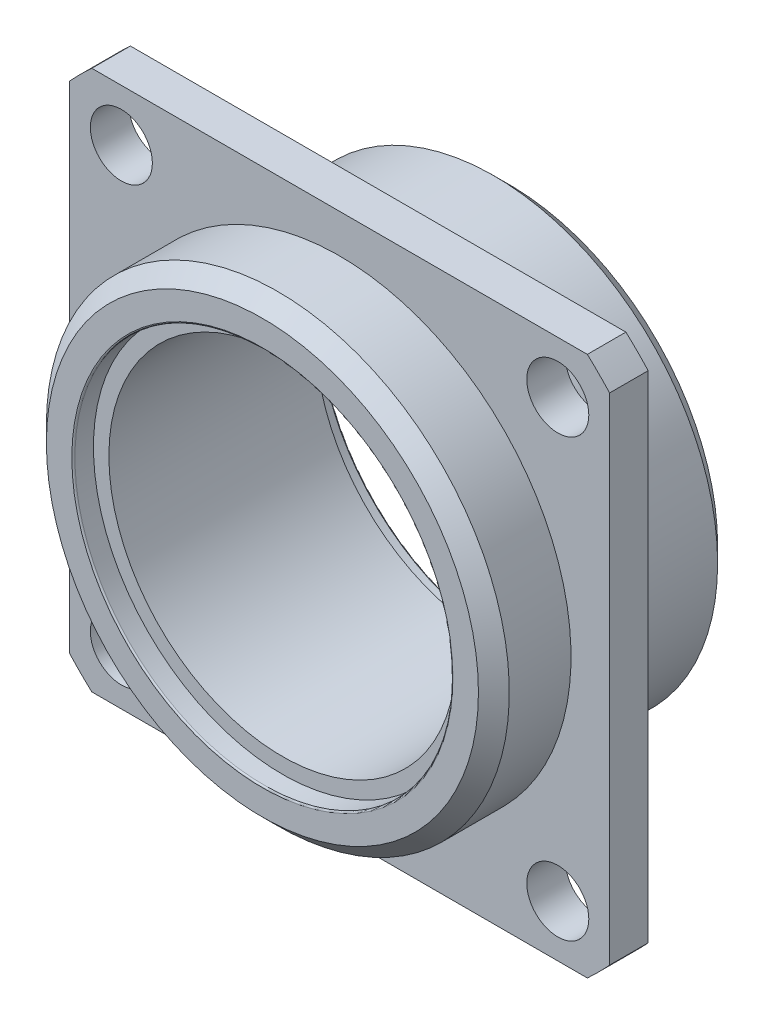
ISO-10303-21;
HEADER;
FILE_DESCRIPTION(('STEP AP214'),'2;1');
FILE_NAME('part.step','',(''),(''),'','','');
FILE_SCHEMA(('AUTOMOTIVE_DESIGN { 1 0 10303 214 1 1 1 1 }'));
ENDSEC;
DATA;
#1=APPLICATION_CONTEXT('core data for automotive mechanical design processes');
#2=APPLICATION_PROTOCOL_DEFINITION('international standard','automotive_design',2000,#1);
#3=PRODUCT_CONTEXT('',#1,'mechanical');
#4=PRODUCT('Part','Part','',(#3));
#5=PRODUCT_RELATED_PRODUCT_CATEGORY('part','',(#4));
#6=PRODUCT_DEFINITION_FORMATION('','',#4);
#7=PRODUCT_DEFINITION_CONTEXT('part definition',#1,'design');
#8=PRODUCT_DEFINITION('design','',#6,#7);
#9=PRODUCT_DEFINITION_SHAPE('','',#8);
#10=(LENGTH_UNIT() NAMED_UNIT(*) SI_UNIT(.MILLI.,.METRE.));
#11=(NAMED_UNIT(*) PLANE_ANGLE_UNIT() SI_UNIT($,.RADIAN.));
#12=(NAMED_UNIT(*) SI_UNIT($,.STERADIAN.) SOLID_ANGLE_UNIT());
#13=UNCERTAINTY_MEASURE_WITH_UNIT(LENGTH_MEASURE(1.E-05),#10,'distance_accuracy_value','');
#14=(GEOMETRIC_REPRESENTATION_CONTEXT(3) GLOBAL_UNCERTAINTY_ASSIGNED_CONTEXT((#13)) GLOBAL_UNIT_ASSIGNED_CONTEXT((#10,
#11,#12)) REPRESENTATION_CONTEXT('',''));
#15=CARTESIAN_POINT('',(0.,0.,0.));
#16=DIRECTION('',(0.,0.,1.));
#17=DIRECTION('',(1.,0.,0.));
#18=AXIS2_PLACEMENT_3D('',#15,#16,#17);
#19=CARTESIAN_POINT('',(0.,0.,4.699));
#20=DIRECTION('',(0.,0.,1.));
#21=DIRECTION('',(1.,0.,0.));
#22=AXIS2_PLACEMENT_3D('',#19,#20,#21);
#23=PLANE('',#22);
#24=CARTESIAN_POINT('',(0.,0.,4.699));
#25=DIRECTION('',(0.,0.,1.));
#26=DIRECTION('',(1.,0.,0.));
#27=AXIS2_PLACEMENT_3D('',#24,#25,#26);
#28=CIRCLE('',#27,14.2875);
#29=CARTESIAN_POINT('',(14.2875,0.,4.699));
#30=VERTEX_POINT('',#29);
#31=EDGE_CURVE('E241',#30,#30,#28,.F.);
#32=ORIENTED_EDGE('',*,*,#31,.T.);
#33=EDGE_LOOP('',(#32));
#34=FACE_BOUND('',#33,.T.);
#35=CARTESIAN_POINT('',(0.,0.,4.699));
#36=DIRECTION('',(0.,0.,1.));
#37=DIRECTION('',(1.,0.,0.));
#38=AXIS2_PLACEMENT_3D('',#35,#36,#37);
#39=CIRCLE('',#38,15.5575);
#40=CARTESIAN_POINT('',(15.5575,0.,4.699));
#41=VERTEX_POINT('',#40);
#42=EDGE_CURVE('E238',#41,#41,#39,.T.);
#43=ORIENTED_EDGE('',*,*,#42,.T.);
#44=EDGE_LOOP('',(#43));
#45=FACE_BOUND('',#44,.T.);
#46=ADVANCED_FACE('F14',(#34,#45),#23,.T.);
#47=CARTESIAN_POINT('',(0.,0.,-13.97));
#48=DIRECTION('',(0.,0.,1.));
#49=DIRECTION('',(1.,0.,0.));
#50=AXIS2_PLACEMENT_3D('',#47,#48,#49);
#51=CYLINDRICAL_SURFACE('',#50,14.2875);
#52=ORIENTED_EDGE('',*,*,#31,.F.);
#53=EDGE_LOOP('',(#52));
#54=FACE_BOUND('',#53,.T.);
#55=CARTESIAN_POINT('',(0.,0.,-12.319));
#56=DIRECTION('',(0.,0.,1.));
#57=DIRECTION('',(1.,0.,0.));
#58=AXIS2_PLACEMENT_3D('',#55,#56,#57);
#59=CIRCLE('',#58,14.2875);
#60=CARTESIAN_POINT('',(14.2875,0.,-12.319));
#61=VERTEX_POINT('',#60);
#62=EDGE_CURVE('E164',#61,#61,#59,.T.);
#63=ORIENTED_EDGE('',*,*,#62,.F.);
#64=EDGE_LOOP('',(#63));
#65=FACE_BOUND('',#64,.T.);
#66=ADVANCED_FACE('F472',(#54,#65),#51,.F.);
#67=CARTESIAN_POINT('',(0.,0.,4.699));
#68=DIRECTION('',(0.,0.,1.));
#69=DIRECTION('',(1.,0.,0.));
#70=AXIS2_PLACEMENT_3D('',#67,#68,#69);
#71=CYLINDRICAL_SURFACE('',#70,15.5575);
#72=ORIENTED_EDGE('',*,*,#42,.F.);
#73=EDGE_LOOP('',(#72));
#74=FACE_BOUND('',#73,.T.);
#75=CARTESIAN_POINT('',(0.,0.,6.223));
#76=DIRECTION('',(0.,0.,1.));
#77=DIRECTION('',(1.,0.,0.));
#78=AXIS2_PLACEMENT_3D('',#75,#76,#77);
#79=CIRCLE('',#78,15.5575);
#80=CARTESIAN_POINT('',(15.5575,0.,6.223));
#81=VERTEX_POINT('',#80);
#82=EDGE_CURVE('E157',#81,#81,#79,.F.);
#83=ORIENTED_EDGE('',*,*,#82,.F.);
#84=EDGE_LOOP('',(#83));
#85=FACE_BOUND('',#84,.T.);
#86=ADVANCED_FACE('F463',(#74,#85),#71,.F.);
#87=CARTESIAN_POINT('',(0.,0.,-12.319));
#88=DIRECTION('',(0.,0.,-1.));
#89=DIRECTION('',(-1.,0.,0.));
#90=AXIS2_PLACEMENT_3D('',#87,#88,#89);
#91=PLANE('',#90);
#92=ORIENTED_EDGE('',*,*,#62,.T.);
#93=EDGE_LOOP('',(#92));
#94=FACE_BOUND('',#93,.T.);
#95=CARTESIAN_POINT('',(0.,0.,-12.319));
#96=DIRECTION('',(0.,0.,-1.));
#97=DIRECTION('',(-1.,0.,0.));
#98=AXIS2_PLACEMENT_3D('',#95,#96,#97);
#99=CIRCLE('',#98,15.5575);
#100=CARTESIAN_POINT('',(-15.5575,0.,-12.319));
#101=VERTEX_POINT('',#100);
#102=EDGE_CURVE('E111',#101,#101,#99,.T.);
#103=ORIENTED_EDGE('',*,*,#102,.T.);
#104=EDGE_LOOP('',(#103));
#105=FACE_BOUND('',#104,.T.);
#106=ADVANCED_FACE('F150',(#94,#105),#91,.T.);
#107=CARTESIAN_POINT('',(0.,0.,6.223));
#108=DIRECTION('',(0.,0.,1.));
#109=DIRECTION('',(1.,0.,0.));
#110=AXIS2_PLACEMENT_3D('',#107,#108,#109);
#111=TOROIDAL_SURFACE('',#110,15.6845,0.127);
#112=ORIENTED_EDGE('',*,*,#82,.T.);
#113=EDGE_LOOP('',(#112));
#114=FACE_BOUND('',#113,.T.);
#115=CARTESIAN_POINT('',(0.,0.,6.35));
#116=DIRECTION('',(0.,0.,1.));
#117=DIRECTION('',(1.,0.,0.));
#118=AXIS2_PLACEMENT_3D('',#115,#116,#117);
#119=CIRCLE('',#118,15.6845);
#120=CARTESIAN_POINT('',(-15.6845,0.,6.35));
#121=VERTEX_POINT('',#120);
#122=CARTESIAN_POINT('',(15.6845,0.,6.35));
#123=VERTEX_POINT('',#122);
#124=EDGE_CURVE('E101',#121,#123,#119,.F.);
#125=ORIENTED_EDGE('',*,*,#124,.F.);
#126=CARTESIAN_POINT('',(0.,0.,6.35));
#127=DIRECTION('',(0.,0.,1.));
#128=DIRECTION('',(-1.,0.,0.));
#129=AXIS2_PLACEMENT_3D('',#126,#127,#128);
#130=CIRCLE('',#129,15.6845);
#131=EDGE_CURVE('E99',#123,#121,#130,.F.);
#132=ORIENTED_EDGE('',*,*,#131,.F.);
#133=EDGE_LOOP('',(#125,#132));
#134=FACE_BOUND('',#133,.T.);
#135=ADVANCED_FACE('F103',(#114,#134),#111,.T.);
#136=CARTESIAN_POINT('',(0.,0.,-12.319));
#137=DIRECTION('',(0.,0.,-1.));
#138=DIRECTION('',(-1.,0.,0.));
#139=AXIS2_PLACEMENT_3D('',#136,#137,#138);
#140=CYLINDRICAL_SURFACE('',#139,15.5575);
#141=ORIENTED_EDGE('',*,*,#102,.F.);
#142=EDGE_LOOP('',(#141));
#143=FACE_BOUND('',#142,.T.);
#144=CARTESIAN_POINT('',(0.,0.,-13.843));
#145=DIRECTION('',(0.,0.,-1.));
#146=DIRECTION('',(-1.,0.,0.));
#147=AXIS2_PLACEMENT_3D('',#144,#145,#146);
#148=CIRCLE('',#147,15.5575);
#149=CARTESIAN_POINT('',(-15.5575,0.,-13.843));
#150=VERTEX_POINT('',#149);
#151=EDGE_CURVE('E106',#150,#150,#148,.F.);
#152=ORIENTED_EDGE('',*,*,#151,.F.);
#153=EDGE_LOOP('',(#152));
#154=FACE_BOUND('',#153,.T.);
#155=ADVANCED_FACE('F130',(#143,#154),#140,.F.);
#156=CARTESIAN_POINT('',(0.,0.,6.35));
#157=DIRECTION('',(0.,0.,1.));
#158=DIRECTION('',(1.,0.,0.));
#159=AXIS2_PLACEMENT_3D('',#156,#157,#158);
#160=PLANE('',#159);
#161=CARTESIAN_POINT('',(0.,0.,6.35));
#162=DIRECTION('',(0.,0.,-1.));
#163=DIRECTION('',(-1.,0.,0.));
#164=AXIS2_PLACEMENT_3D('',#161,#162,#163);
#165=CIRCLE('',#164,17.78);
#166=CARTESIAN_POINT('',(-17.78,0.,6.35));
#167=VERTEX_POINT('',#166);
#168=EDGE_CURVE('E145',#167,#167,#165,.T.);
#169=ORIENTED_EDGE('',*,*,#168,.F.);
#170=EDGE_LOOP('',(#169));
#171=FACE_BOUND('',#170,.T.);
#172=ORIENTED_EDGE('',*,*,#131,.T.);
#173=ORIENTED_EDGE('',*,*,#124,.T.);
#174=EDGE_LOOP('',(#172,#173));
#175=FACE_BOUND('',#174,.T.);
#176=ADVANCED_FACE('F110',(#171,#175),#160,.T.);
#177=CARTESIAN_POINT('',(0.,0.,-13.843));
#178=DIRECTION('',(0.,0.,-1.));
#179=DIRECTION('',(-1.,0.,0.));
#180=AXIS2_PLACEMENT_3D('',#177,#178,#179);
#181=TOROIDAL_SURFACE('',#180,15.6845,0.127);
#182=ORIENTED_EDGE('',*,*,#151,.T.);
#183=EDGE_LOOP('',(#182));
#184=FACE_BOUND('',#183,.T.);
#185=CARTESIAN_POINT('',(0.,0.,-13.97));
#186=DIRECTION('',(0.,0.,-1.));
#187=DIRECTION('',(-1.,0.,0.));
#188=AXIS2_PLACEMENT_3D('',#185,#186,#187);
#189=CIRCLE('',#188,15.6845);
#190=CARTESIAN_POINT('',(15.6845,0.,-13.97));
#191=VERTEX_POINT('',#190);
#192=CARTESIAN_POINT('',(-15.6845,0.,-13.97));
#193=VERTEX_POINT('',#192);
#194=EDGE_CURVE('E90',#191,#193,#189,.F.);
#195=ORIENTED_EDGE('',*,*,#194,.F.);
#196=CARTESIAN_POINT('',(0.,0.,-13.97));
#197=DIRECTION('',(0.,0.,-1.));
#198=DIRECTION('',(1.,0.,0.));
#199=AXIS2_PLACEMENT_3D('',#196,#197,#198);
#200=CIRCLE('',#199,15.6845);
#201=EDGE_CURVE('E233',#193,#191,#200,.F.);
#202=ORIENTED_EDGE('',*,*,#201,.F.);
#203=EDGE_LOOP('',(#195,#202));
#204=FACE_BOUND('',#203,.T.);
#205=ADVANCED_FACE('F129',(#184,#204),#181,.T.);
#206=CARTESIAN_POINT('',(0.,0.,5.08000000000001));
#207=DIRECTION('',(0.,0.,-1.));
#208=DIRECTION('',(-1.,0.,0.));
#209=AXIS2_PLACEMENT_3D('',#206,#207,#208);
#210=CONICAL_SURFACE('',#209,19.05,0.785398163397449);
#211=ORIENTED_EDGE('',*,*,#168,.T.);
#212=EDGE_LOOP('',(#211));
#213=FACE_BOUND('',#212,.T.);
#214=CARTESIAN_POINT('',(0.,0.,5.08000000000001));
#215=DIRECTION('',(0.,0.,-1.));
#216=DIRECTION('',(-1.,0.,0.));
#217=AXIS2_PLACEMENT_3D('',#214,#215,#216);
#218=CIRCLE('',#217,19.05);
#219=CARTESIAN_POINT('',(-19.05,0.,5.08000000000001));
#220=VERTEX_POINT('',#219);
#221=EDGE_CURVE('E230',#220,#220,#218,.T.);
#222=ORIENTED_EDGE('',*,*,#221,.F.);
#223=EDGE_LOOP('',(#222));
#224=FACE_BOUND('',#223,.T.);
#225=ADVANCED_FACE('F273',(#213,#224),#210,.T.);
#226=CARTESIAN_POINT('',(0.,0.,-13.97));
#227=DIRECTION('',(0.,0.,-1.));
#228=DIRECTION('',(-1.,0.,0.));
#229=AXIS2_PLACEMENT_3D('',#226,#227,#228);
#230=PLANE('',#229);
#231=CARTESIAN_POINT('',(0.,0.,-13.97));
#232=DIRECTION('',(0.,0.,1.));
#233=DIRECTION('',(1.,0.,0.));
#234=AXIS2_PLACEMENT_3D('',#231,#232,#233);
#235=CIRCLE('',#234,17.145);
#236=CARTESIAN_POINT('',(17.145,0.,-13.97));
#237=VERTEX_POINT('',#236);
#238=EDGE_CURVE('E227',#237,#237,#235,.T.);
#239=ORIENTED_EDGE('',*,*,#238,.F.);
#240=EDGE_LOOP('',(#239));
#241=FACE_BOUND('',#240,.T.);
#242=ORIENTED_EDGE('',*,*,#201,.T.);
#243=ORIENTED_EDGE('',*,*,#194,.T.);
#244=EDGE_LOOP('',(#242,#243));
#245=FACE_BOUND('',#244,.T.);
#246=ADVANCED_FACE('F255',(#241,#245),#230,.T.);
#247=CARTESIAN_POINT('',(0.,0.,6.35));
#248=DIRECTION('',(0.,0.,-1.));
#249=DIRECTION('',(-1.,0.,0.));
#250=AXIS2_PLACEMENT_3D('',#247,#248,#249);
#251=CYLINDRICAL_SURFACE('',#250,19.05);
#252=ORIENTED_EDGE('',*,*,#221,.T.);
#253=EDGE_LOOP('',(#252));
#254=FACE_BOUND('',#253,.T.);
#255=CARTESIAN_POINT('',(0.,0.,0.));
#256=DIRECTION('',(0.,0.,-1.));
#257=DIRECTION('',(-1.,0.,0.));
#258=AXIS2_PLACEMENT_3D('',#255,#256,#257);
#259=CIRCLE('',#258,19.05);
#260=CARTESIAN_POINT('',(-19.05,0.,0.));
#261=VERTEX_POINT('',#260);
#262=EDGE_CURVE('E224',#261,#261,#259,.F.);
#263=ORIENTED_EDGE('',*,*,#262,.T.);
#264=EDGE_LOOP('',(#263));
#265=FACE_BOUND('',#264,.T.);
#266=ADVANCED_FACE('F272',(#254,#265),#251,.T.);
#267=CARTESIAN_POINT('',(0.,0.,-12.7));
#268=DIRECTION('',(0.,0.,1.));
#269=DIRECTION('',(1.,0.,0.));
#270=AXIS2_PLACEMENT_3D('',#267,#268,#269);
#271=CONICAL_SURFACE('',#270,18.415,0.785398163397443);
#272=CARTESIAN_POINT('',(0.,0.,-12.7));
#273=DIRECTION('',(0.,0.,1.));
#274=DIRECTION('',(1.,0.,0.));
#275=AXIS2_PLACEMENT_3D('',#272,#273,#274);
#276=CIRCLE('',#275,18.415);
#277=CARTESIAN_POINT('',(18.415,0.,-12.7));
#278=VERTEX_POINT('',#277);
#279=EDGE_CURVE('E214',#278,#278,#276,.T.);
#280=ORIENTED_EDGE('',*,*,#279,.F.);
#281=EDGE_LOOP('',(#280));
#282=FACE_BOUND('',#281,.T.);
#283=ORIENTED_EDGE('',*,*,#238,.T.);
#284=EDGE_LOOP('',(#283));
#285=FACE_BOUND('',#284,.T.);
#286=ADVANCED_FACE('F346',(#282,#285),#271,.T.);
#287=CARTESIAN_POINT('',(0.,0.,0.));
#288=DIRECTION('',(0.,0.,-1.));
#289=DIRECTION('',(-1.,0.,0.));
#290=AXIS2_PLACEMENT_3D('',#287,#288,#289);
#291=PLANE('',#290);
#292=CARTESIAN_POINT('',(-17.9605122421388,17.9605122421392,0.));
#293=DIRECTION('',(0.,0.,1.));
#294=DIRECTION('',(1.,0.,0.));
#295=AXIS2_PLACEMENT_3D('',#292,#293,#294);
#296=CIRCLE('',#295,2.5527);
#297=CARTESIAN_POINT('',(-15.4078122421388,17.9605122421392,0.));
#298=VERTEX_POINT('',#297);
#299=EDGE_CURVE('E211',#298,#298,#296,.F.);
#300=ORIENTED_EDGE('',*,*,#299,.T.);
#301=EDGE_LOOP('',(#300));
#302=FACE_BOUND('',#301,.T.);
#303=DIRECTION('',(0.,1.,0.));
#304=VECTOR('',#303,1.);
#305=CARTESIAN_POINT('',(-22.225,22.225,0.));
#306=LINE('',#305,#304);
#307=CARTESIAN_POINT('',(-22.225,20.3918067186309,0.));
#308=VERTEX_POINT('',#307);
#309=CARTESIAN_POINT('',(-22.225,-20.3918067186309,0.));
#310=VERTEX_POINT('',#309);
#311=EDGE_CURVE('E81',#308,#310,#306,.F.);
#312=ORIENTED_EDGE('',*,*,#311,.T.);
#313=CARTESIAN_POINT('',(0.,0.,0.));
#314=DIRECTION('',(0.,0.,1.));
#315=DIRECTION('',(1.,0.,0.));
#316=AXIS2_PLACEMENT_3D('',#313,#314,#315);
#317=CIRCLE('',#316,30.1625);
#318=CARTESIAN_POINT('',(-20.3918067186309,-22.225,0.));
#319=VERTEX_POINT('',#318);
#320=EDGE_CURVE('E193',#319,#310,#317,.F.);
#321=ORIENTED_EDGE('',*,*,#320,.F.);
#322=DIRECTION('',(1.,0.,0.));
#323=VECTOR('',#322,1.);
#324=CARTESIAN_POINT('',(22.225,-22.225,0.));
#325=LINE('',#324,#323);
#326=CARTESIAN_POINT('',(20.3918067186309,-22.225,0.));
#327=VERTEX_POINT('',#326);
#328=EDGE_CURVE('E199',#319,#327,#325,.T.);
#329=ORIENTED_EDGE('',*,*,#328,.T.);
#330=CARTESIAN_POINT('',(0.,0.,0.));
#331=DIRECTION('',(0.,0.,1.));
#332=DIRECTION('',(1.,0.,0.));
#333=AXIS2_PLACEMENT_3D('',#330,#331,#332);
#334=CIRCLE('',#333,30.1625);
#335=CARTESIAN_POINT('',(22.225,-20.3918067186309,0.));
#336=VERTEX_POINT('',#335);
#337=EDGE_CURVE('E196',#336,#327,#334,.F.);
#338=ORIENTED_EDGE('',*,*,#337,.F.);
#339=DIRECTION('',(0.,-1.,0.));
#340=VECTOR('',#339,1.);
#341=CARTESIAN_POINT('',(22.225,22.225,0.));
#342=LINE('',#341,#340);
#343=CARTESIAN_POINT('',(22.225,20.3918067186309,0.));
#344=VERTEX_POINT('',#343);
#345=EDGE_CURVE('E204',#336,#344,#342,.F.);
#346=ORIENTED_EDGE('',*,*,#345,.T.);
#347=CARTESIAN_POINT('',(0.,0.,0.));
#348=DIRECTION('',(0.,0.,1.));
#349=DIRECTION('',(1.,0.,0.));
#350=AXIS2_PLACEMENT_3D('',#347,#348,#349);
#351=CIRCLE('',#350,30.1625);
#352=CARTESIAN_POINT('',(20.3918067186309,22.225,0.));
#353=VERTEX_POINT('',#352);
#354=EDGE_CURVE('E201',#353,#344,#351,.F.);
#355=ORIENTED_EDGE('',*,*,#354,.F.);
#356=DIRECTION('',(1.,0.,0.));
#357=VECTOR('',#356,1.);
#358=CARTESIAN_POINT('',(22.225,22.225,0.));
#359=LINE('',#358,#357);
#360=CARTESIAN_POINT('',(-20.3918067186309,22.225,0.));
#361=VERTEX_POINT('',#360);
#362=EDGE_CURVE('E209',#353,#361,#359,.F.);
#363=ORIENTED_EDGE('',*,*,#362,.T.);
#364=CARTESIAN_POINT('',(0.,0.,0.));
#365=DIRECTION('',(0.,0.,1.));
#366=DIRECTION('',(1.,0.,0.));
#367=AXIS2_PLACEMENT_3D('',#364,#365,#366);
#368=CIRCLE('',#367,30.1625);
#369=EDGE_CURVE('E206',#308,#361,#368,.F.);
#370=ORIENTED_EDGE('',*,*,#369,.F.);
#371=EDGE_LOOP('',(#312,#321,#329,#338,#346,#355,#363,#370));
#372=FACE_BOUND('',#371,.T.);
#373=ORIENTED_EDGE('',*,*,#262,.F.);
#374=EDGE_LOOP('',(#373));
#375=FACE_BOUND('',#374,.T.);
#376=CARTESIAN_POINT('',(-17.9605122421392,-17.9605122421389,0.));
#377=DIRECTION('',(0.,0.,1.));
#378=DIRECTION('',(1.,0.,0.));
#379=AXIS2_PLACEMENT_3D('',#376,#377,#378);
#380=CIRCLE('',#379,2.5527);
#381=CARTESIAN_POINT('',(-15.4078122421392,-17.9605122421389,0.));
#382=VERTEX_POINT('',#381);
#383=EDGE_CURVE('E215',#382,#382,#380,.F.);
#384=ORIENTED_EDGE('',*,*,#383,.T.);
#385=EDGE_LOOP('',(#384));
#386=FACE_BOUND('',#385,.T.);
#387=CARTESIAN_POINT('',(17.960512242139,-17.9605122421391,0.));
#388=DIRECTION('',(0.,0.,1.));
#389=DIRECTION('',(1.,0.,0.));
#390=AXIS2_PLACEMENT_3D('',#387,#388,#389);
#391=CIRCLE('',#390,2.5527);
#392=CARTESIAN_POINT('',(20.513212242139,-17.9605122421391,0.));
#393=VERTEX_POINT('',#392);
#394=EDGE_CURVE('E218',#393,#393,#391,.F.);
#395=ORIENTED_EDGE('',*,*,#394,.T.);
#396=EDGE_LOOP('',(#395));
#397=FACE_BOUND('',#396,.T.);
#398=CARTESIAN_POINT('',(17.960512242139,17.960512242139,0.));
#399=DIRECTION('',(0.,0.,1.));
#400=DIRECTION('',(1.,0.,0.));
#401=AXIS2_PLACEMENT_3D('',#398,#399,#400);
#402=CIRCLE('',#401,2.5527);
#403=CARTESIAN_POINT('',(20.513212242139,17.960512242139,0.));
#404=VERTEX_POINT('',#403);
#405=EDGE_CURVE('E221',#404,#404,#402,.F.);
#406=ORIENTED_EDGE('',*,*,#405,.T.);
#407=EDGE_LOOP('',(#406));
#408=FACE_BOUND('',#407,.T.);
#409=ADVANCED_FACE('F343',(#302,#372,#375,#386,#397,#408),#291,.F.);
#410=CARTESIAN_POINT('',(17.960512242139,17.960512242139,0.));
#411=DIRECTION('',(0.,0.,1.));
#412=DIRECTION('',(1.,0.,0.));
#413=AXIS2_PLACEMENT_3D('',#410,#411,#412);
#414=CYLINDRICAL_SURFACE('',#413,2.5527);
#415=CARTESIAN_POINT('',(17.960512242139,17.960512242139,-3.175));
#416=DIRECTION('',(0.,0.,1.));
#417=DIRECTION('',(1.,0.,0.));
#418=AXIS2_PLACEMENT_3D('',#415,#416,#417);
#419=CIRCLE('',#418,2.5527);
#420=CARTESIAN_POINT('',(20.513212242139,17.960512242139,-3.175));
#421=VERTEX_POINT('',#420);
#422=EDGE_CURVE('E190',#421,#421,#419,.T.);
#423=ORIENTED_EDGE('',*,*,#422,.F.);
#424=EDGE_LOOP('',(#423));
#425=FACE_BOUND('',#424,.T.);
#426=ORIENTED_EDGE('',*,*,#405,.F.);
#427=EDGE_LOOP('',(#426));
#428=FACE_BOUND('',#427,.T.);
#429=ADVANCED_FACE('F339',(#425,#428),#414,.F.);
#430=CARTESIAN_POINT('',(17.960512242139,-17.9605122421391,0.));
#431=DIRECTION('',(0.,0.,1.));
#432=DIRECTION('',(1.,0.,0.));
#433=AXIS2_PLACEMENT_3D('',#430,#431,#432);
#434=CYLINDRICAL_SURFACE('',#433,2.5527);
#435=CARTESIAN_POINT('',(17.960512242139,-17.9605122421391,-3.175));
#436=DIRECTION('',(0.,0.,1.));
#437=DIRECTION('',(1.,0.,0.));
#438=AXIS2_PLACEMENT_3D('',#435,#436,#437);
#439=CIRCLE('',#438,2.5527);
#440=CARTESIAN_POINT('',(20.513212242139,-17.9605122421391,-3.175));
#441=VERTEX_POINT('',#440);
#442=EDGE_CURVE('E187',#441,#441,#439,.T.);
#443=ORIENTED_EDGE('',*,*,#442,.F.);
#444=EDGE_LOOP('',(#443));
#445=FACE_BOUND('',#444,.T.);
#446=ORIENTED_EDGE('',*,*,#394,.F.);
#447=EDGE_LOOP('',(#446));
#448=FACE_BOUND('',#447,.T.);
#449=ADVANCED_FACE('F335',(#445,#448),#434,.F.);
#450=CARTESIAN_POINT('',(-17.9605122421392,-17.9605122421389,0.));
#451=DIRECTION('',(0.,0.,1.));
#452=DIRECTION('',(1.,0.,0.));
#453=AXIS2_PLACEMENT_3D('',#450,#451,#452);
#454=CYLINDRICAL_SURFACE('',#453,2.5527);
#455=CARTESIAN_POINT('',(-17.9605122421392,-17.9605122421389,-3.175));
#456=DIRECTION('',(0.,0.,1.));
#457=DIRECTION('',(1.,0.,0.));
#458=AXIS2_PLACEMENT_3D('',#455,#456,#457);
#459=CIRCLE('',#458,2.5527);
#460=CARTESIAN_POINT('',(-15.4078122421392,-17.9605122421389,-3.175));
#461=VERTEX_POINT('',#460);
#462=EDGE_CURVE('E184',#461,#461,#459,.T.);
#463=ORIENTED_EDGE('',*,*,#462,.F.);
#464=EDGE_LOOP('',(#463));
#465=FACE_BOUND('',#464,.T.);
#466=ORIENTED_EDGE('',*,*,#383,.F.);
#467=EDGE_LOOP('',(#466));
#468=FACE_BOUND('',#467,.T.);
#469=ADVANCED_FACE('F331',(#465,#468),#454,.F.);
#470=CARTESIAN_POINT('',(-17.9605122421388,17.9605122421392,0.));
#471=DIRECTION('',(0.,0.,1.));
#472=DIRECTION('',(1.,0.,0.));
#473=AXIS2_PLACEMENT_3D('',#470,#471,#472);
#474=CYLINDRICAL_SURFACE('',#473,2.5527);
#475=CARTESIAN_POINT('',(-17.9605122421388,17.9605122421392,-3.175));
#476=DIRECTION('',(0.,0.,1.));
#477=DIRECTION('',(1.,0.,0.));
#478=AXIS2_PLACEMENT_3D('',#475,#476,#477);
#479=CIRCLE('',#478,2.5527);
#480=CARTESIAN_POINT('',(-15.4078122421388,17.9605122421392,-3.175));
#481=VERTEX_POINT('',#480);
#482=EDGE_CURVE('E181',#481,#481,#479,.T.);
#483=ORIENTED_EDGE('',*,*,#482,.F.);
#484=EDGE_LOOP('',(#483));
#485=FACE_BOUND('',#484,.T.);
#486=ORIENTED_EDGE('',*,*,#299,.F.);
#487=EDGE_LOOP('',(#486));
#488=FACE_BOUND('',#487,.T.);
#489=ADVANCED_FACE('F327',(#485,#488),#474,.F.);
#490=CARTESIAN_POINT('',(0.,0.,-13.97));
#491=DIRECTION('',(0.,0.,1.));
#492=DIRECTION('',(1.,0.,0.));
#493=AXIS2_PLACEMENT_3D('',#490,#491,#492);
#494=CYLINDRICAL_SURFACE('',#493,18.415);
#495=CARTESIAN_POINT('',(0.,0.,-3.175));
#496=DIRECTION('',(0.,0.,1.));
#497=DIRECTION('',(1.,0.,0.));
#498=AXIS2_PLACEMENT_3D('',#495,#496,#497);
#499=CIRCLE('',#498,18.415);
#500=CARTESIAN_POINT('',(18.415,0.,-3.175));
#501=VERTEX_POINT('',#500);
#502=EDGE_CURVE('E178',#501,#501,#499,.T.);
#503=ORIENTED_EDGE('',*,*,#502,.F.);
#504=EDGE_LOOP('',(#503));
#505=FACE_BOUND('',#504,.T.);
#506=ORIENTED_EDGE('',*,*,#279,.T.);
#507=EDGE_LOOP('',(#506));
#508=FACE_BOUND('',#507,.T.);
#509=ADVANCED_FACE('F324',(#505,#508),#494,.T.);
#510=CARTESIAN_POINT('',(-22.225,22.225,-3.175));
#511=DIRECTION('',(1.,0.,0.));
#512=DIRECTION('',(0.,1.,0.));
#513=AXIS2_PLACEMENT_3D('',#510,#511,#512);
#514=PLANE('',#513);
#515=DIRECTION('',(0.,1.,0.));
#516=VECTOR('',#515,1.);
#517=CARTESIAN_POINT('',(-22.225,0.,-3.175));
#518=LINE('',#517,#516);
#519=CARTESIAN_POINT('',(-22.225,-20.3918067186309,-3.175));
#520=VERTEX_POINT('',#519);
#521=CARTESIAN_POINT('',(-22.225,20.3918067186309,-3.175));
#522=VERTEX_POINT('',#521);
#523=EDGE_CURVE('E177',#520,#522,#518,.T.);
#524=ORIENTED_EDGE('',*,*,#523,.F.);
#525=DIRECTION('',(0.,0.,1.));
#526=VECTOR('',#525,1.);
#527=CARTESIAN_POINT('',(-22.225,-20.3918067186309,-13.97));
#528=LINE('',#527,#526);
#529=EDGE_CURVE('E377',#310,#520,#528,.F.);
#530=ORIENTED_EDGE('',*,*,#529,.F.);
#531=ORIENTED_EDGE('',*,*,#311,.F.);
#532=DIRECTION('',(0.,0.,1.));
#533=VECTOR('',#532,1.);
#534=CARTESIAN_POINT('',(-22.225,20.3918067186309,-13.97));
#535=LINE('',#534,#533);
#536=EDGE_CURVE('E210',#522,#308,#535,.T.);
#537=ORIENTED_EDGE('',*,*,#536,.F.);
#538=EDGE_LOOP('',(#524,#530,#531,#537));
#539=FACE_BOUND('',#538,.T.);
#540=ADVANCED_FACE('F320',(#539),#514,.F.);
#541=CARTESIAN_POINT('',(0.,0.,-13.97));
#542=DIRECTION('',(0.,0.,1.));
#543=DIRECTION('',(1.,0.,0.));
#544=AXIS2_PLACEMENT_3D('',#541,#542,#543);
#545=CYLINDRICAL_SURFACE('',#544,30.1625);
#546=DIRECTION('',(0.,0.,-1.));
#547=VECTOR('',#546,1.);
#548=CARTESIAN_POINT('',(-20.3918067186309,22.225,-3.175));
#549=LINE('',#548,#547);
#550=CARTESIAN_POINT('',(-20.3918067186309,22.225,-3.175));
#551=VERTEX_POINT('',#550);
#552=EDGE_CURVE('E363',#361,#551,#549,.T.);
#553=ORIENTED_EDGE('',*,*,#552,.T.);
#554=CARTESIAN_POINT('',(0.,0.,-3.175));
#555=DIRECTION('',(0.,0.,1.));
#556=DIRECTION('',(1.,0.,0.));
#557=AXIS2_PLACEMENT_3D('',#554,#555,#556);
#558=CIRCLE('',#557,30.1625);
#559=EDGE_CURVE('E174',#522,#551,#558,.F.);
#560=ORIENTED_EDGE('',*,*,#559,.F.);
#561=ORIENTED_EDGE('',*,*,#536,.T.);
#562=ORIENTED_EDGE('',*,*,#369,.T.);
#563=EDGE_LOOP('',(#553,#560,#561,#562));
#564=FACE_BOUND('',#563,.T.);
#565=ADVANCED_FACE('F316',(#564),#545,.T.);
#566=CARTESIAN_POINT('',(22.225,22.225,-3.175));
#567=DIRECTION('',(0.,-1.,0.));
#568=DIRECTION('',(0.,0.,-1.));
#569=AXIS2_PLACEMENT_3D('',#566,#567,#568);
#570=PLANE('',#569);
#571=DIRECTION('',(-1.,0.,0.));
#572=VECTOR('',#571,1.);
#573=CARTESIAN_POINT('',(0.,22.225,-3.175));
#574=LINE('',#573,#572);
#575=CARTESIAN_POINT('',(20.3918067186309,22.225,-3.175));
#576=VERTEX_POINT('',#575);
#577=EDGE_CURVE('E173',#551,#576,#574,.F.);
#578=ORIENTED_EDGE('',*,*,#577,.F.);
#579=ORIENTED_EDGE('',*,*,#552,.F.);
#580=ORIENTED_EDGE('',*,*,#362,.F.);
#581=DIRECTION('',(0.,0.,1.));
#582=VECTOR('',#581,1.);
#583=CARTESIAN_POINT('',(20.3918067186309,22.225,-13.97));
#584=LINE('',#583,#582);
#585=EDGE_CURVE('E205',#576,#353,#584,.T.);
#586=ORIENTED_EDGE('',*,*,#585,.F.);
#587=EDGE_LOOP('',(#578,#579,#580,#586));
#588=FACE_BOUND('',#587,.T.);
#589=ADVANCED_FACE('F312',(#588),#570,.F.);
#590=CARTESIAN_POINT('',(0.,0.,-13.97));
#591=DIRECTION('',(0.,0.,1.));
#592=DIRECTION('',(1.,0.,0.));
#593=AXIS2_PLACEMENT_3D('',#590,#591,#592);
#594=CYLINDRICAL_SURFACE('',#593,30.1625);
#595=DIRECTION('',(0.,0.,1.));
#596=VECTOR('',#595,1.);
#597=CARTESIAN_POINT('',(22.225,20.3918067186309,-3.175));
#598=LINE('',#597,#596);
#599=CARTESIAN_POINT('',(22.225,20.3918067186309,-3.175));
#600=VERTEX_POINT('',#599);
#601=EDGE_CURVE('E364',#344,#600,#598,.F.);
#602=ORIENTED_EDGE('',*,*,#601,.T.);
#603=CARTESIAN_POINT('',(0.,0.,-3.175));
#604=DIRECTION('',(0.,0.,1.));
#605=DIRECTION('',(1.,0.,0.));
#606=AXIS2_PLACEMENT_3D('',#603,#604,#605);
#607=CIRCLE('',#606,30.1625);
#608=EDGE_CURVE('E170',#576,#600,#607,.F.);
#609=ORIENTED_EDGE('',*,*,#608,.F.);
#610=ORIENTED_EDGE('',*,*,#585,.T.);
#611=ORIENTED_EDGE('',*,*,#354,.T.);
#612=EDGE_LOOP('',(#602,#609,#610,#611));
#613=FACE_BOUND('',#612,.T.);
#614=ADVANCED_FACE('F308',(#613),#594,.T.);
#615=CARTESIAN_POINT('',(22.225,22.225,-3.175));
#616=DIRECTION('',(-1.,0.,0.));
#617=DIRECTION('',(0.,-1.,0.));
#618=AXIS2_PLACEMENT_3D('',#615,#616,#617);
#619=PLANE('',#618);
#620=DIRECTION('',(0.,1.,0.));
#621=VECTOR('',#620,1.);
#622=CARTESIAN_POINT('',(22.225,0.,-3.175));
#623=LINE('',#622,#621);
#624=CARTESIAN_POINT('',(22.225,-20.3918067186309,-3.175));
#625=VERTEX_POINT('',#624);
#626=EDGE_CURVE('E169',#600,#625,#623,.F.);
#627=ORIENTED_EDGE('',*,*,#626,.F.);
#628=ORIENTED_EDGE('',*,*,#601,.F.);
#629=ORIENTED_EDGE('',*,*,#345,.F.);
#630=DIRECTION('',(0.,0.,1.));
#631=VECTOR('',#630,1.);
#632=CARTESIAN_POINT('',(22.225,-20.3918067186309,-13.97));
#633=LINE('',#632,#631);
#634=EDGE_CURVE('E200',#625,#336,#633,.T.);
#635=ORIENTED_EDGE('',*,*,#634,.F.);
#636=EDGE_LOOP('',(#627,#628,#629,#635));
#637=FACE_BOUND('',#636,.T.);
#638=ADVANCED_FACE('F304',(#637),#619,.F.);
#639=CARTESIAN_POINT('',(0.,0.,-13.97));
#640=DIRECTION('',(0.,0.,1.));
#641=DIRECTION('',(1.,0.,0.));
#642=AXIS2_PLACEMENT_3D('',#639,#640,#641);
#643=CYLINDRICAL_SURFACE('',#642,30.1625);
#644=DIRECTION('',(0.,0.,1.));
#645=VECTOR('',#644,1.);
#646=CARTESIAN_POINT('',(20.3918067186309,-22.225,-3.175));
#647=LINE('',#646,#645);
#648=CARTESIAN_POINT('',(20.3918067186309,-22.225,-3.175));
#649=VERTEX_POINT('',#648);
#650=EDGE_CURVE('E367',#327,#649,#647,.F.);
#651=ORIENTED_EDGE('',*,*,#650,.T.);
#652=CARTESIAN_POINT('',(0.,0.,-3.175));
#653=DIRECTION('',(0.,0.,1.));
#654=DIRECTION('',(1.,0.,0.));
#655=AXIS2_PLACEMENT_3D('',#652,#653,#654);
#656=CIRCLE('',#655,30.1625);
#657=EDGE_CURVE('E166',#625,#649,#656,.F.);
#658=ORIENTED_EDGE('',*,*,#657,.F.);
#659=ORIENTED_EDGE('',*,*,#634,.T.);
#660=ORIENTED_EDGE('',*,*,#337,.T.);
#661=EDGE_LOOP('',(#651,#658,#659,#660));
#662=FACE_BOUND('',#661,.T.);
#663=ADVANCED_FACE('F301',(#662),#643,.T.);
#664=CARTESIAN_POINT('',(22.225,-22.225,-3.175));
#665=DIRECTION('',(0.,1.,0.));
#666=DIRECTION('',(0.,0.,1.));
#667=AXIS2_PLACEMENT_3D('',#664,#665,#666);
#668=PLANE('',#667);
#669=DIRECTION('',(-1.,0.,0.));
#670=VECTOR('',#669,1.);
#671=CARTESIAN_POINT('',(0.,-22.225,-3.175));
#672=LINE('',#671,#670);
#673=CARTESIAN_POINT('',(-20.3918067186309,-22.225,-3.175));
#674=VERTEX_POINT('',#673);
#675=EDGE_CURVE('E25',#649,#674,#672,.T.);
#676=ORIENTED_EDGE('',*,*,#675,.F.);
#677=ORIENTED_EDGE('',*,*,#650,.F.);
#678=ORIENTED_EDGE('',*,*,#328,.F.);
#679=DIRECTION('',(0.,0.,1.));
#680=VECTOR('',#679,1.);
#681=CARTESIAN_POINT('',(-20.3918067186309,-22.225,-13.97));
#682=LINE('',#681,#680);
#683=EDGE_CURVE('E34',#674,#319,#682,.T.);
#684=ORIENTED_EDGE('',*,*,#683,.F.);
#685=EDGE_LOOP('',(#676,#677,#678,#684));
#686=FACE_BOUND('',#685,.T.);
#687=ADVANCED_FACE('F293',(#686),#668,.F.);
#688=CARTESIAN_POINT('',(0.,0.,-13.97));
#689=DIRECTION('',(0.,0.,1.));
#690=DIRECTION('',(1.,0.,0.));
#691=AXIS2_PLACEMENT_3D('',#688,#689,#690);
#692=CYLINDRICAL_SURFACE('',#691,30.1625);
#693=ORIENTED_EDGE('',*,*,#683,.T.);
#694=ORIENTED_EDGE('',*,*,#320,.T.);
#695=ORIENTED_EDGE('',*,*,#529,.T.);
#696=CARTESIAN_POINT('',(0.,0.,-3.175));
#697=DIRECTION('',(0.,0.,1.));
#698=DIRECTION('',(1.,0.,0.));
#699=AXIS2_PLACEMENT_3D('',#696,#697,#698);
#700=CIRCLE('',#699,30.1625);
#701=EDGE_CURVE('E9',#674,#520,#700,.F.);
#702=ORIENTED_EDGE('',*,*,#701,.F.);
#703=EDGE_LOOP('',(#693,#694,#695,#702));
#704=FACE_BOUND('',#703,.T.);
#705=ADVANCED_FACE('F287',(#704),#692,.T.);
#706=CARTESIAN_POINT('',(0.,0.,-3.175));
#707=DIRECTION('',(0.,0.,-1.));
#708=DIRECTION('',(-1.,0.,0.));
#709=AXIS2_PLACEMENT_3D('',#706,#707,#708);
#710=PLANE('',#709);
#711=ORIENTED_EDGE('',*,*,#675,.T.);
#712=ORIENTED_EDGE('',*,*,#701,.T.);
#713=ORIENTED_EDGE('',*,*,#523,.T.);
#714=ORIENTED_EDGE('',*,*,#559,.T.);
#715=ORIENTED_EDGE('',*,*,#577,.T.);
#716=ORIENTED_EDGE('',*,*,#608,.T.);
#717=ORIENTED_EDGE('',*,*,#626,.T.);
#718=ORIENTED_EDGE('',*,*,#657,.T.);
#719=EDGE_LOOP('',(#711,#712,#713,#714,#715,#716,#717,#718));
#720=FACE_BOUND('',#719,.T.);
#721=ORIENTED_EDGE('',*,*,#502,.T.);
#722=EDGE_LOOP('',(#721));
#723=FACE_BOUND('',#722,.T.);
#724=ORIENTED_EDGE('',*,*,#482,.T.);
#725=EDGE_LOOP('',(#724));
#726=FACE_BOUND('',#725,.T.);
#727=ORIENTED_EDGE('',*,*,#462,.T.);
#728=EDGE_LOOP('',(#727));
#729=FACE_BOUND('',#728,.T.);
#730=ORIENTED_EDGE('',*,*,#442,.T.);
#731=EDGE_LOOP('',(#730));
#732=FACE_BOUND('',#731,.T.);
#733=ORIENTED_EDGE('',*,*,#422,.T.);
#734=EDGE_LOOP('',(#733));
#735=FACE_BOUND('',#734,.T.);
#736=ADVANCED_FACE('F285',(#720,#723,#726,#729,#732,#735),#710,.T.);
#737=CLOSED_SHELL('',(#46,#66,#86,#106,#135,#155,#176,#205,#225,#246,#266,#286,#409,#429,#449,
#469,#489,#509,#540,#565,#589,#614,#638,#663,#687,#705,#736));
#738=MANIFOLD_SOLID_BREP('B1',#737);
#739=ADVANCED_BREP_SHAPE_REPRESENTATION('',(#18,#738),#14);
#740=SHAPE_DEFINITION_REPRESENTATION(#9,#739);
ENDSEC;
END-ISO-10303-21;
